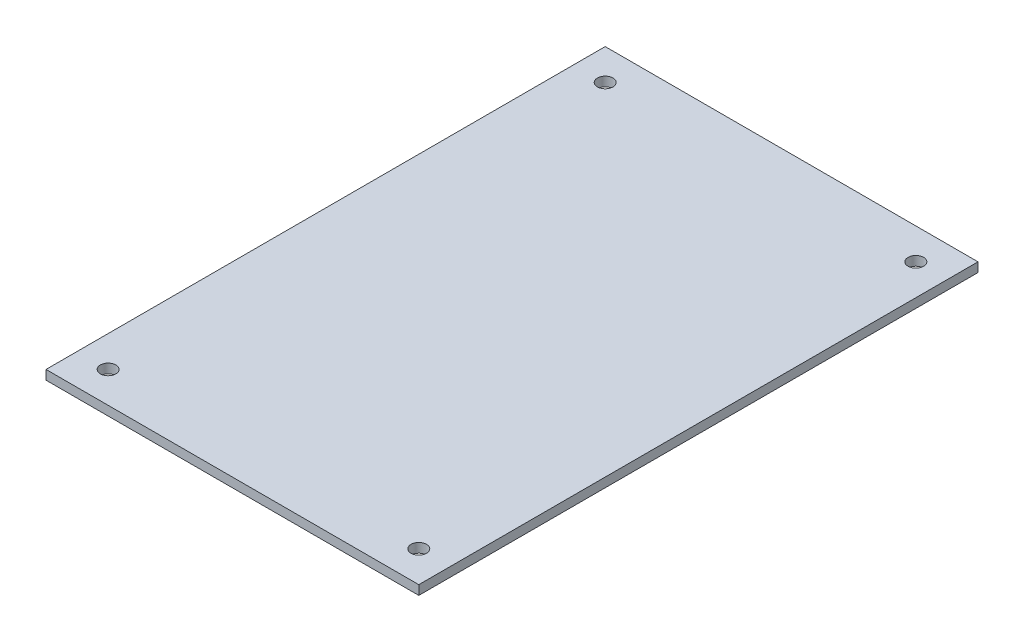
ISO-10303-21;
HEADER;
FILE_DESCRIPTION(('STEP AP214'),'2;1');
FILE_NAME('part.step','',(''),(''),'','','');
FILE_SCHEMA(('AUTOMOTIVE_DESIGN { 1 0 10303 214 1 1 1 1 }'));
ENDSEC;
DATA;
#1=APPLICATION_CONTEXT('core data for automotive mechanical design processes');
#2=APPLICATION_PROTOCOL_DEFINITION('international standard','automotive_design',2000,#1);
#3=PRODUCT_CONTEXT('',#1,'mechanical');
#4=PRODUCT('Part','Part','',(#3));
#5=PRODUCT_RELATED_PRODUCT_CATEGORY('part','',(#4));
#6=PRODUCT_DEFINITION_FORMATION('','',#4);
#7=PRODUCT_DEFINITION_CONTEXT('part definition',#1,'design');
#8=PRODUCT_DEFINITION('design','',#6,#7);
#9=PRODUCT_DEFINITION_SHAPE('','',#8);
#10=(LENGTH_UNIT() NAMED_UNIT(*) SI_UNIT(.MILLI.,.METRE.));
#11=(NAMED_UNIT(*) PLANE_ANGLE_UNIT() SI_UNIT($,.RADIAN.));
#12=(NAMED_UNIT(*) SI_UNIT($,.STERADIAN.) SOLID_ANGLE_UNIT());
#13=UNCERTAINTY_MEASURE_WITH_UNIT(LENGTH_MEASURE(1.E-05),#10,'distance_accuracy_value','');
#14=(GEOMETRIC_REPRESENTATION_CONTEXT(3) GLOBAL_UNCERTAINTY_ASSIGNED_CONTEXT((#13)) GLOBAL_UNIT_ASSIGNED_CONTEXT((#10,
#11,#12)) REPRESENTATION_CONTEXT('',''));
#15=CARTESIAN_POINT('',(0.,0.,0.));
#16=DIRECTION('',(0.,0.,1.));
#17=DIRECTION('',(1.,0.,0.));
#18=AXIS2_PLACEMENT_3D('',#15,#16,#17);
#19=CARTESIAN_POINT('',(0.,3.,0.));
#20=DIRECTION('',(0.,1.,0.));
#21=DIRECTION('',(0.,0.,1.));
#22=AXIS2_PLACEMENT_3D('',#19,#20,#21);
#23=PLANE('',#22);
#24=CARTESIAN_POINT('',(50.,3.,80.));
#25=DIRECTION('',(0.,1.,0.));
#26=DIRECTION('',(0.,0.,1.));
#27=AXIS2_PLACEMENT_3D('',#24,#25,#26);
#28=CIRCLE('',#27,2.5);
#29=CARTESIAN_POINT('',(50.,3.,82.5));
#30=VERTEX_POINT('',#29);
#31=EDGE_CURVE('E125',#30,#30,#28,.T.);
#32=ORIENTED_EDGE('',*,*,#31,.F.);
#33=EDGE_LOOP('',(#32));
#34=FACE_BOUND('',#33,.T.);
#35=CARTESIAN_POINT('',(-50.,3.,-80.));
#36=DIRECTION('',(0.,1.,0.));
#37=DIRECTION('',(0.,0.,1.));
#38=AXIS2_PLACEMENT_3D('',#35,#36,#37);
#39=CIRCLE('',#38,2.50000000000001);
#40=CARTESIAN_POINT('',(-50.,3.,-77.5));
#41=VERTEX_POINT('',#40);
#42=EDGE_CURVE('E104',#41,#41,#39,.T.);
#43=ORIENTED_EDGE('',*,*,#42,.F.);
#44=EDGE_LOOP('',(#43));
#45=FACE_BOUND('',#44,.T.);
#46=DIRECTION('',(0.,0.,-1.));
#47=VECTOR('',#46,1.);
#48=CARTESIAN_POINT('',(60.,3.,-90.));
#49=LINE('',#48,#47);
#50=CARTESIAN_POINT('',(60.,3.,90.));
#51=VERTEX_POINT('',#50);
#52=CARTESIAN_POINT('',(60.,3.,-90.));
#53=VERTEX_POINT('',#52);
#54=EDGE_CURVE('E89',#51,#53,#49,.T.);
#55=ORIENTED_EDGE('',*,*,#54,.T.);
#56=DIRECTION('',(-1.,0.,0.));
#57=VECTOR('',#56,1.);
#58=CARTESIAN_POINT('',(-60.,3.,-90.));
#59=LINE('',#58,#57);
#60=CARTESIAN_POINT('',(-60.,3.,-90.));
#61=VERTEX_POINT('',#60);
#62=EDGE_CURVE('E84',#53,#61,#59,.T.);
#63=ORIENTED_EDGE('',*,*,#62,.T.);
#64=DIRECTION('',(0.,0.,1.));
#65=VECTOR('',#64,1.);
#66=CARTESIAN_POINT('',(-60.,3.,-90.));
#67=LINE('',#66,#65);
#68=CARTESIAN_POINT('',(-60.,3.,90.));
#69=VERTEX_POINT('',#68);
#70=EDGE_CURVE('E87',#61,#69,#67,.T.);
#71=ORIENTED_EDGE('',*,*,#70,.T.);
#72=DIRECTION('',(1.,0.,0.));
#73=VECTOR('',#72,1.);
#74=CARTESIAN_POINT('',(-60.,3.,90.));
#75=LINE('',#74,#73);
#76=EDGE_CURVE('E54',#69,#51,#75,.T.);
#77=ORIENTED_EDGE('',*,*,#76,.T.);
#78=EDGE_LOOP('',(#55,#63,#71,#77));
#79=FACE_BOUND('',#78,.T.);
#80=CARTESIAN_POINT('',(50.,3.,-80.));
#81=DIRECTION('',(0.,1.,0.));
#82=DIRECTION('',(0.,0.,-1.));
#83=AXIS2_PLACEMENT_3D('',#80,#81,#82);
#84=CIRCLE('',#83,2.50000000000001);
#85=CARTESIAN_POINT('',(50.,3.,-82.5));
#86=VERTEX_POINT('',#85);
#87=EDGE_CURVE('E119',#86,#86,#84,.T.);
#88=ORIENTED_EDGE('',*,*,#87,.F.);
#89=EDGE_LOOP('',(#88));
#90=FACE_BOUND('',#89,.T.);
#91=CARTESIAN_POINT('',(-50.,3.,80.));
#92=DIRECTION('',(0.,1.,0.));
#93=DIRECTION('',(0.,0.,-1.));
#94=AXIS2_PLACEMENT_3D('',#91,#92,#93);
#95=CIRCLE('',#94,2.50000000000001);
#96=CARTESIAN_POINT('',(-50.,3.,77.5));
#97=VERTEX_POINT('',#96);
#98=EDGE_CURVE('E131',#97,#97,#95,.T.);
#99=ORIENTED_EDGE('',*,*,#98,.F.);
#100=EDGE_LOOP('',(#99));
#101=FACE_BOUND('',#100,.T.);
#102=ADVANCED_FACE('F37',(#34,#45,#79,#90,#101),#23,.T.);
#103=CARTESIAN_POINT('',(0.,0.,0.));
#104=DIRECTION('',(0.,1.,0.));
#105=DIRECTION('',(0.,0.,1.));
#106=AXIS2_PLACEMENT_3D('',#103,#104,#105);
#107=PLANE('',#106);
#108=DIRECTION('',(0.,0.,-1.));
#109=VECTOR('',#108,1.);
#110=CARTESIAN_POINT('',(60.,0.,-90.));
#111=LINE('',#110,#109);
#112=CARTESIAN_POINT('',(60.,0.,90.));
#113=VERTEX_POINT('',#112);
#114=CARTESIAN_POINT('',(60.,0.,-90.));
#115=VERTEX_POINT('',#114);
#116=EDGE_CURVE('E101',#113,#115,#111,.T.);
#117=ORIENTED_EDGE('',*,*,#116,.F.);
#118=DIRECTION('',(1.,0.,0.));
#119=VECTOR('',#118,1.);
#120=CARTESIAN_POINT('',(-60.,0.,90.));
#121=LINE('',#120,#119);
#122=CARTESIAN_POINT('',(-60.,0.,90.));
#123=VERTEX_POINT('',#122);
#124=EDGE_CURVE('E77',#123,#113,#121,.T.);
#125=ORIENTED_EDGE('',*,*,#124,.F.);
#126=DIRECTION('',(0.,0.,1.));
#127=VECTOR('',#126,1.);
#128=CARTESIAN_POINT('',(-60.,0.,-90.));
#129=LINE('',#128,#127);
#130=CARTESIAN_POINT('',(-60.,0.,-90.));
#131=VERTEX_POINT('',#130);
#132=EDGE_CURVE('E71',#131,#123,#129,.T.);
#133=ORIENTED_EDGE('',*,*,#132,.F.);
#134=DIRECTION('',(-1.,0.,0.));
#135=VECTOR('',#134,1.);
#136=CARTESIAN_POINT('',(-60.,0.,-90.));
#137=LINE('',#136,#135);
#138=EDGE_CURVE('E93',#115,#131,#137,.T.);
#139=ORIENTED_EDGE('',*,*,#138,.F.);
#140=EDGE_LOOP('',(#117,#125,#133,#139));
#141=FACE_BOUND('',#140,.T.);
#142=CARTESIAN_POINT('',(-50.,0.,-80.));
#143=DIRECTION('',(0.,1.,0.));
#144=DIRECTION('',(0.,0.,1.));
#145=AXIS2_PLACEMENT_3D('',#142,#143,#144);
#146=CIRCLE('',#145,2.50000000000001);
#147=CARTESIAN_POINT('',(-50.,0.,-77.5));
#148=VERTEX_POINT('',#147);
#149=EDGE_CURVE('E116',#148,#148,#146,.T.);
#150=ORIENTED_EDGE('',*,*,#149,.T.);
#151=EDGE_LOOP('',(#150));
#152=FACE_BOUND('',#151,.T.);
#153=CARTESIAN_POINT('',(50.,0.,-80.));
#154=DIRECTION('',(0.,1.,0.));
#155=DIRECTION('',(0.,0.,-1.));
#156=AXIS2_PLACEMENT_3D('',#153,#154,#155);
#157=CIRCLE('',#156,2.50000000000001);
#158=CARTESIAN_POINT('',(50.,0.,-82.5));
#159=VERTEX_POINT('',#158);
#160=EDGE_CURVE('E122',#159,#159,#157,.T.);
#161=ORIENTED_EDGE('',*,*,#160,.T.);
#162=EDGE_LOOP('',(#161));
#163=FACE_BOUND('',#162,.T.);
#164=CARTESIAN_POINT('',(50.,0.,80.));
#165=DIRECTION('',(0.,1.,0.));
#166=DIRECTION('',(0.,0.,1.));
#167=AXIS2_PLACEMENT_3D('',#164,#165,#166);
#168=CIRCLE('',#167,2.5);
#169=CARTESIAN_POINT('',(50.,0.,82.5));
#170=VERTEX_POINT('',#169);
#171=EDGE_CURVE('E128',#170,#170,#168,.T.);
#172=ORIENTED_EDGE('',*,*,#171,.T.);
#173=EDGE_LOOP('',(#172));
#174=FACE_BOUND('',#173,.T.);
#175=CARTESIAN_POINT('',(-50.,0.,80.));
#176=DIRECTION('',(0.,1.,0.));
#177=DIRECTION('',(0.,0.,-1.));
#178=AXIS2_PLACEMENT_3D('',#175,#176,#177);
#179=CIRCLE('',#178,2.50000000000001);
#180=CARTESIAN_POINT('',(-50.,0.,77.5));
#181=VERTEX_POINT('',#180);
#182=EDGE_CURVE('E134',#181,#181,#179,.T.);
#183=ORIENTED_EDGE('',*,*,#182,.T.);
#184=EDGE_LOOP('',(#183));
#185=FACE_BOUND('',#184,.T.);
#186=ADVANCED_FACE('F112',(#141,#152,#163,#174,#185),#107,.F.);
#187=CARTESIAN_POINT('',(60.,3.,-90.));
#188=DIRECTION('',(-1.,0.,0.));
#189=DIRECTION('',(0.,0.,1.));
#190=AXIS2_PLACEMENT_3D('',#187,#188,#189);
#191=PLANE('',#190);
#192=ORIENTED_EDGE('',*,*,#116,.T.);
#193=DIRECTION('',(0.,-1.,0.));
#194=VECTOR('',#193,1.);
#195=CARTESIAN_POINT('',(60.,3.,-90.));
#196=LINE('',#195,#194);
#197=EDGE_CURVE('E11',#53,#115,#196,.T.);
#198=ORIENTED_EDGE('',*,*,#197,.F.);
#199=ORIENTED_EDGE('',*,*,#54,.F.);
#200=DIRECTION('',(0.,-1.,0.));
#201=VECTOR('',#200,1.);
#202=CARTESIAN_POINT('',(60.,3.,90.));
#203=LINE('',#202,#201);
#204=EDGE_CURVE('E97',#51,#113,#203,.T.);
#205=ORIENTED_EDGE('',*,*,#204,.T.);
#206=EDGE_LOOP('',(#192,#198,#199,#205));
#207=FACE_BOUND('',#206,.T.);
#208=ADVANCED_FACE('F39',(#207),#191,.F.);
#209=CARTESIAN_POINT('',(-60.,3.,-90.));
#210=DIRECTION('',(0.,0.,1.));
#211=DIRECTION('',(1.,0.,0.));
#212=AXIS2_PLACEMENT_3D('',#209,#210,#211);
#213=PLANE('',#212);
#214=ORIENTED_EDGE('',*,*,#138,.T.);
#215=DIRECTION('',(0.,-1.,0.));
#216=VECTOR('',#215,1.);
#217=CARTESIAN_POINT('',(-60.,3.,-90.));
#218=LINE('',#217,#216);
#219=EDGE_CURVE('E46',#61,#131,#218,.T.);
#220=ORIENTED_EDGE('',*,*,#219,.F.);
#221=ORIENTED_EDGE('',*,*,#62,.F.);
#222=ORIENTED_EDGE('',*,*,#197,.T.);
#223=EDGE_LOOP('',(#214,#220,#221,#222));
#224=FACE_BOUND('',#223,.T.);
#225=ADVANCED_FACE('F92',(#224),#213,.F.);
#226=CARTESIAN_POINT('',(-60.,3.,-90.));
#227=DIRECTION('',(1.,0.,0.));
#228=DIRECTION('',(0.,0.,-1.));
#229=AXIS2_PLACEMENT_3D('',#226,#227,#228);
#230=PLANE('',#229);
#231=ORIENTED_EDGE('',*,*,#132,.T.);
#232=DIRECTION('',(0.,-1.,0.));
#233=VECTOR('',#232,1.);
#234=CARTESIAN_POINT('',(-60.,3.,90.));
#235=LINE('',#234,#233);
#236=EDGE_CURVE('E94',#69,#123,#235,.T.);
#237=ORIENTED_EDGE('',*,*,#236,.F.);
#238=ORIENTED_EDGE('',*,*,#70,.F.);
#239=ORIENTED_EDGE('',*,*,#219,.T.);
#240=EDGE_LOOP('',(#231,#237,#238,#239));
#241=FACE_BOUND('',#240,.T.);
#242=ADVANCED_FACE('F95',(#241),#230,.F.);
#243=CARTESIAN_POINT('',(-60.,3.,90.));
#244=DIRECTION('',(0.,0.,-1.));
#245=DIRECTION('',(-1.,0.,0.));
#246=AXIS2_PLACEMENT_3D('',#243,#244,#245);
#247=PLANE('',#246);
#248=ORIENTED_EDGE('',*,*,#124,.T.);
#249=ORIENTED_EDGE('',*,*,#204,.F.);
#250=ORIENTED_EDGE('',*,*,#76,.F.);
#251=ORIENTED_EDGE('',*,*,#236,.T.);
#252=EDGE_LOOP('',(#248,#249,#250,#251));
#253=FACE_BOUND('',#252,.T.);
#254=ADVANCED_FACE('F109',(#253),#247,.F.);
#255=CARTESIAN_POINT('',(-50.,3.,-80.));
#256=DIRECTION('',(0.,-1.,0.));
#257=DIRECTION('',(0.,0.,-1.));
#258=AXIS2_PLACEMENT_3D('',#255,#256,#257);
#259=CYLINDRICAL_SURFACE('',#258,2.50000000000001);
#260=ORIENTED_EDGE('',*,*,#42,.T.);
#261=EDGE_LOOP('',(#260));
#262=FACE_BOUND('',#261,.T.);
#263=ORIENTED_EDGE('',*,*,#149,.F.);
#264=EDGE_LOOP('',(#263));
#265=FACE_BOUND('',#264,.T.);
#266=ADVANCED_FACE('F153',(#262,#265),#259,.F.);
#267=CARTESIAN_POINT('',(50.,3.,-80.));
#268=DIRECTION('',(0.,-1.,0.));
#269=DIRECTION('',(0.,0.,-1.));
#270=AXIS2_PLACEMENT_3D('',#267,#268,#269);
#271=CYLINDRICAL_SURFACE('',#270,2.50000000000001);
#272=ORIENTED_EDGE('',*,*,#87,.T.);
#273=EDGE_LOOP('',(#272));
#274=FACE_BOUND('',#273,.T.);
#275=ORIENTED_EDGE('',*,*,#160,.F.);
#276=EDGE_LOOP('',(#275));
#277=FACE_BOUND('',#276,.T.);
#278=ADVANCED_FACE('F207',(#274,#277),#271,.F.);
#279=CARTESIAN_POINT('',(50.,3.,80.));
#280=DIRECTION('',(0.,-1.,0.));
#281=DIRECTION('',(0.,0.,-1.));
#282=AXIS2_PLACEMENT_3D('',#279,#280,#281);
#283=CYLINDRICAL_SURFACE('',#282,2.5);
#284=ORIENTED_EDGE('',*,*,#31,.T.);
#285=EDGE_LOOP('',(#284));
#286=FACE_BOUND('',#285,.T.);
#287=ORIENTED_EDGE('',*,*,#171,.F.);
#288=EDGE_LOOP('',(#287));
#289=FACE_BOUND('',#288,.T.);
#290=ADVANCED_FACE('F216',(#286,#289),#283,.F.);
#291=CARTESIAN_POINT('',(-50.,3.,80.));
#292=DIRECTION('',(0.,-1.,0.));
#293=DIRECTION('',(0.,0.,-1.));
#294=AXIS2_PLACEMENT_3D('',#291,#292,#293);
#295=CYLINDRICAL_SURFACE('',#294,2.50000000000001);
#296=ORIENTED_EDGE('',*,*,#98,.T.);
#297=EDGE_LOOP('',(#296));
#298=FACE_BOUND('',#297,.T.);
#299=ORIENTED_EDGE('',*,*,#182,.F.);
#300=EDGE_LOOP('',(#299));
#301=FACE_BOUND('',#300,.T.);
#302=ADVANCED_FACE('F140',(#298,#301),#295,.F.);
#303=CLOSED_SHELL('',(#102,#186,#208,#225,#242,#254,#266,#278,#290,#302));
#304=MANIFOLD_SOLID_BREP('B2',#303);
#305=ADVANCED_BREP_SHAPE_REPRESENTATION('',(#18,#304),#14);
#306=SHAPE_DEFINITION_REPRESENTATION(#9,#305);
ENDSEC;
END-ISO-10303-21;
